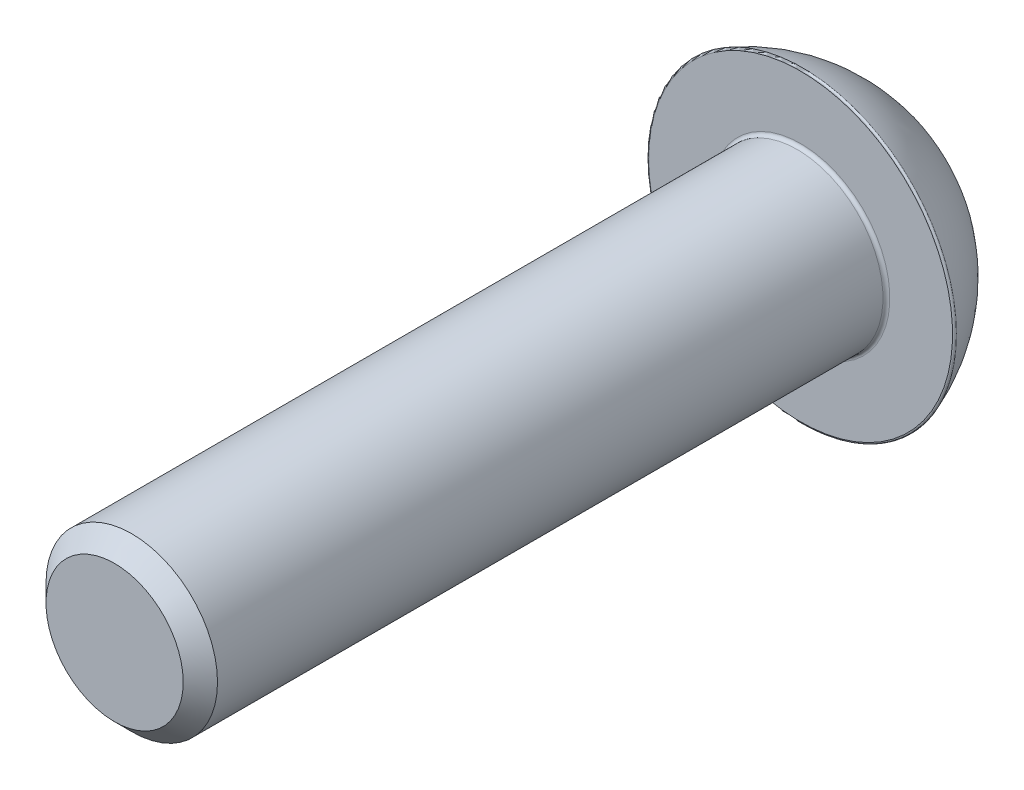
ISO-10303-21;
HEADER;
FILE_DESCRIPTION(('STEP AP214'),'2;1');
FILE_NAME('part.step','',(''),(''),'','','');
FILE_SCHEMA(('AUTOMOTIVE_DESIGN { 1 0 10303 214 1 1 1 1 }'));
ENDSEC;
DATA;
#1=APPLICATION_CONTEXT('core data for automotive mechanical design processes');
#2=APPLICATION_PROTOCOL_DEFINITION('international standard','automotive_design',2000,#1);
#3=PRODUCT_CONTEXT('',#1,'mechanical');
#4=PRODUCT('Part','Part','',(#3));
#5=PRODUCT_RELATED_PRODUCT_CATEGORY('part','',(#4));
#6=PRODUCT_DEFINITION_FORMATION('','',#4);
#7=PRODUCT_DEFINITION_CONTEXT('part definition',#1,'design');
#8=PRODUCT_DEFINITION('design','',#6,#7);
#9=PRODUCT_DEFINITION_SHAPE('','',#8);
#10=(LENGTH_UNIT() NAMED_UNIT(*) SI_UNIT(.MILLI.,.METRE.));
#11=(NAMED_UNIT(*) PLANE_ANGLE_UNIT() SI_UNIT($,.RADIAN.));
#12=(NAMED_UNIT(*) SI_UNIT($,.STERADIAN.) SOLID_ANGLE_UNIT());
#13=UNCERTAINTY_MEASURE_WITH_UNIT(LENGTH_MEASURE(1.E-05),#10,'distance_accuracy_value','');
#14=(GEOMETRIC_REPRESENTATION_CONTEXT(3) GLOBAL_UNCERTAINTY_ASSIGNED_CONTEXT((#13)) GLOBAL_UNIT_ASSIGNED_CONTEXT((#10,
#11,#12)) REPRESENTATION_CONTEXT('',''));
#15=CARTESIAN_POINT('',(0.,0.,0.));
#16=DIRECTION('',(0.,0.,1.));
#17=DIRECTION('',(1.,0.,0.));
#18=AXIS2_PLACEMENT_3D('',#15,#16,#17);
#19=CARTESIAN_POINT('',(0.,0.,20.));
#20=DIRECTION('',(0.,0.,-1.));
#21=DIRECTION('',(-1.,0.,0.));
#22=AXIS2_PLACEMENT_3D('',#19,#20,#21);
#23=CYLINDRICAL_SURFACE('',#22,2.5);
#24=CARTESIAN_POINT('',(0.,0.,19.5));
#25=DIRECTION('',(0.,0.,1.));
#26=DIRECTION('',(1.,0.,0.));
#27=AXIS2_PLACEMENT_3D('',#24,#25,#26);
#28=CIRCLE('',#27,2.5);
#29=CARTESIAN_POINT('',(2.5,0.,19.5));
#30=VERTEX_POINT('',#29);
#31=EDGE_CURVE('E257',#30,#30,#28,.F.);
#32=ORIENTED_EDGE('',*,*,#31,.T.);
#33=EDGE_LOOP('',(#32));
#34=FACE_BOUND('',#33,.T.);
#35=CARTESIAN_POINT('',(0.,0.,0.0999999999999994));
#36=DIRECTION('',(0.,0.,-1.));
#37=DIRECTION('',(-1.,0.,0.));
#38=AXIS2_PLACEMENT_3D('',#35,#36,#37);
#39=CIRCLE('',#38,2.5);
#40=CARTESIAN_POINT('',(-2.5,0.,0.0999999999999994));
#41=VERTEX_POINT('',#40);
#42=EDGE_CURVE('E273',#41,#41,#39,.F.);
#43=ORIENTED_EDGE('',*,*,#42,.T.);
#44=EDGE_LOOP('',(#43));
#45=FACE_BOUND('',#44,.T.);
#46=ADVANCED_FACE('F35',(#34,#45),#23,.T.);
#47=CARTESIAN_POINT('',(0.,0.,20.));
#48=DIRECTION('',(0.,0.,1.));
#49=DIRECTION('',(1.,0.,0.));
#50=AXIS2_PLACEMENT_3D('',#47,#48,#49);
#51=PLANE('',#50);
#52=CARTESIAN_POINT('',(0.,0.,20.));
#53=DIRECTION('',(0.,0.,1.));
#54=DIRECTION('',(1.,0.,0.));
#55=AXIS2_PLACEMENT_3D('',#52,#53,#54);
#56=CIRCLE('',#55,2.00000000000001);
#57=CARTESIAN_POINT('',(2.00000000000001,0.,20.));
#58=VERTEX_POINT('',#57);
#59=EDGE_CURVE('E260',#58,#58,#56,.T.);
#60=ORIENTED_EDGE('',*,*,#59,.T.);
#61=EDGE_LOOP('',(#60));
#62=FACE_BOUND('',#61,.T.);
#63=ADVANCED_FACE('F221',(#62),#51,.T.);
#64=CARTESIAN_POINT('',(0.,0.,0.));
#65=DIRECTION('',(0.,0.,-1.));
#66=DIRECTION('',(-1.,0.,0.));
#67=AXIS2_PLACEMENT_3D('',#64,#65,#66);
#68=PLANE('',#67);
#69=CARTESIAN_POINT('',(0.,0.,0.));
#70=DIRECTION('',(0.,0.,-1.));
#71=DIRECTION('',(-1.,0.,0.));
#72=AXIS2_PLACEMENT_3D('',#69,#70,#71);
#73=CIRCLE('',#72,4.42885793235147);
#74=CARTESIAN_POINT('',(-4.42885793235147,0.,0.));
#75=VERTEX_POINT('',#74);
#76=EDGE_CURVE('E43',#75,#75,#73,.F.);
#77=ORIENTED_EDGE('',*,*,#76,.T.);
#78=EDGE_LOOP('',(#77));
#79=FACE_BOUND('',#78,.T.);
#80=CARTESIAN_POINT('',(0.,0.,0.));
#81=DIRECTION('',(0.,0.,-1.));
#82=DIRECTION('',(-1.,0.,0.));
#83=AXIS2_PLACEMENT_3D('',#80,#81,#82);
#84=CIRCLE('',#83,2.6);
#85=CARTESIAN_POINT('',(-2.6,0.,0.));
#86=VERTEX_POINT('',#85);
#87=EDGE_CURVE('E272',#86,#86,#84,.T.);
#88=ORIENTED_EDGE('',*,*,#87,.T.);
#89=EDGE_LOOP('',(#88));
#90=FACE_BOUND('',#89,.T.);
#91=ADVANCED_FACE('F227',(#79,#90),#68,.F.);
#92=CARTESIAN_POINT('',(0.,0.,1.60844917871861));
#93=DIRECTION('',(0.,0.,1.));
#94=DIRECTION('',(1.,0.,0.));
#95=AXIS2_PLACEMENT_3D('',#92,#93,#94);
#96=DEGENERATE_TOROIDAL_SURFACE('',#95,0.0730614733982582,4.84767985741633,.F.);
#97=CARTESIAN_POINT('',(0.,0.,-0.0672838666606202));
#98=DIRECTION('',(0.,0.,1.));
#99=DIRECTION('',(1.,0.,0.));
#100=AXIS2_PLACEMENT_3D('',#97,#98,#99);
#101=CIRCLE('',#100,4.47577560442988);
#102=CARTESIAN_POINT('',(4.47577560442988,0.,-0.0672838666606202));
#103=VERTEX_POINT('',#102);
#104=EDGE_CURVE('E11',#103,#103,#101,.F.);
#105=ORIENTED_EDGE('',*,*,#104,.T.);
#106=EDGE_LOOP('',(#105));
#107=FACE_BOUND('',#106,.T.);
#108=CARTESIAN_POINT('',(0.,0.,-2.46818925995868));
#109=DIRECTION('',(0.,0.,1.));
#110=DIRECTION('',(1.,0.,0.));
#111=AXIS2_PLACEMENT_3D('',#108,#109,#110);
#112=CIRCLE('',#111,2.55010818186593);
#113=CARTESIAN_POINT('',(2.55010818186593,0.,-2.46818925995868));
#114=VERTEX_POINT('',#113);
#115=EDGE_CURVE('E255',#114,#114,#112,.T.);
#116=ORIENTED_EDGE('',*,*,#115,.T.);
#117=EDGE_LOOP('',(#116));
#118=FACE_BOUND('',#117,.T.);
#119=ADVANCED_FACE('F269',(#107,#118),#96,.F.);
#120=CARTESIAN_POINT('',(0.,0.,-2.5));
#121=DIRECTION('',(0.,0.,1.));
#122=DIRECTION('',(1.,0.,0.));
#123=AXIS2_PLACEMENT_3D('',#120,#121,#122);
#124=PLANE('',#123);
#125=CARTESIAN_POINT('',(0.,0.,-2.5));
#126=DIRECTION('',(0.,0.,1.));
#127=DIRECTION('',(1.,0.,0.));
#128=AXIS2_PLACEMENT_3D('',#125,#126,#127);
#129=CIRCLE('',#128,2.44188446526669);
#130=CARTESIAN_POINT('',(2.44188446526669,0.,-2.5));
#131=VERTEX_POINT('',#130);
#132=EDGE_CURVE('E252',#131,#131,#129,.F.);
#133=ORIENTED_EDGE('',*,*,#132,.T.);
#134=EDGE_LOOP('',(#133));
#135=FACE_BOUND('',#134,.T.);
#136=CARTESIAN_POINT('',(0.,0.,-2.5));
#137=DIRECTION('',(0.,0.,1.));
#138=DIRECTION('',(1.,0.,0.));
#139=AXIS2_PLACEMENT_3D('',#136,#137,#138);
#140=CIRCLE('',#139,2.);
#141=CARTESIAN_POINT('',(0.,-2.,-2.5));
#142=VERTEX_POINT('',#141);
#143=CARTESIAN_POINT('',(1.73205080756888,-1.,-2.5));
#144=VERTEX_POINT('',#143);
#145=EDGE_CURVE('E352',#142,#144,#140,.T.);
#146=ORIENTED_EDGE('',*,*,#145,.T.);
#147=CARTESIAN_POINT('',(1.73205080756888,1.,-2.5));
#148=VERTEX_POINT('',#147);
#149=EDGE_CURVE('E354',#144,#148,#140,.T.);
#150=ORIENTED_EDGE('',*,*,#149,.T.);
#151=CARTESIAN_POINT('',(0.,2.,-2.5));
#152=VERTEX_POINT('',#151);
#153=EDGE_CURVE('E142',#148,#152,#140,.T.);
#154=ORIENTED_EDGE('',*,*,#153,.T.);
#155=CARTESIAN_POINT('',(-1.73205080756888,1.,-2.5));
#156=VERTEX_POINT('',#155);
#157=EDGE_CURVE('E356',#152,#156,#140,.T.);
#158=ORIENTED_EDGE('',*,*,#157,.T.);
#159=CARTESIAN_POINT('',(-1.73205080756888,-1.,-2.5));
#160=VERTEX_POINT('',#159);
#161=EDGE_CURVE('E50',#156,#160,#140,.T.);
#162=ORIENTED_EDGE('',*,*,#161,.T.);
#163=EDGE_CURVE('E58',#160,#142,#140,.T.);
#164=ORIENTED_EDGE('',*,*,#163,.T.);
#165=EDGE_LOOP('',(#146,#150,#154,#158,#162,#164));
#166=FACE_BOUND('',#165,.T.);
#167=ADVANCED_FACE('F353',(#135,#166),#124,.F.);
#168=CARTESIAN_POINT('',(0.,0.,-2.5));
#169=DIRECTION('',(0.,0.,-1.));
#170=DIRECTION('',(-1.,0.,0.));
#171=AXIS2_PLACEMENT_3D('',#168,#169,#170);
#172=CONICAL_SURFACE('',#171,2.,0.785398163397464);
#173=CARTESIAN_POINT('',(2.94158946981366,0.301672527757715,-3.45701791048383));
#174=CARTESIAN_POINT('',(2.90054820306106,0.325367714165214,-3.41861088775276));
#175=CARTESIAN_POINT('',(2.85934407611677,0.349156927948219,-3.38043624181836));
#176=CARTESIAN_POINT('',(2.77655399714269,0.396955802330134,-3.30463467220862));
#177=CARTESIAN_POINT('',(2.73496801183124,0.42096548214422,-3.26700779702867));
#178=CARTESIAN_POINT('',(2.60936968777962,0.493479708345186,-3.15490999544632));
#179=CARTESIAN_POINT('',(2.5247072531673,0.542359587758857,-3.08140122304804));
#180=CARTESIAN_POINT('',(2.35073780566959,0.642800895102431,-2.93602500622905));
#181=CARTESIAN_POINT('',(2.26136709370547,0.694399099712587,-2.86425858846806));
#182=CARTESIAN_POINT('',(2.0794570373247,0.799424919732323,-2.72641286560296));
#183=CARTESIAN_POINT('',(1.98692096820441,0.85285064414867,-2.66032791651927));
#184=CARTESIAN_POINT('',(1.84369065399249,0.93554470461504,-2.56695989412528));
#185=CARTESIAN_POINT('',(1.7945811381766,0.963898096791116,-2.53646155718601));
#186=CARTESIAN_POINT('',(1.69509291274447,1.02133765052556,-2.47838413728683));
#187=CARTESIAN_POINT('',(1.64471402333495,1.05042391588761,-2.45080547077753));
#188=CARTESIAN_POINT('',(1.49196731568369,1.1386122686679,-2.37384077286726));
#189=CARTESIAN_POINT('',(1.3873857985501,1.19899243573724,-2.32981215735098));
#190=CARTESIAN_POINT('',(1.23717311405262,1.28571776956755,-2.28363805404776));
#191=CARTESIAN_POINT('',(1.19365445015741,1.31084328188222,-2.27218573919536));
#192=CARTESIAN_POINT('',(1.10596861828131,1.36146872052001,-2.25336637230745));
#193=CARTESIAN_POINT('',(1.0618018111858,1.38696843848585,-2.24599712926544));
#194=CARTESIAN_POINT('',(0.973146461030204,1.43815362876328,-2.23571640805521));
#195=CARTESIAN_POINT('',(0.928658532222327,1.4638387464362,-2.23279794685668));
#196=CARTESIAN_POINT('',(0.839632922634738,1.51523770609636,-2.23155642002916));
#197=CARTESIAN_POINT('',(0.795095241343887,1.54095154837872,-2.2332334020544));
#198=CARTESIAN_POINT('',(0.706440848380417,1.59213618602102,-2.24107938880437));
#199=CARTESIAN_POINT('',(0.662323335765045,1.61760744380548,-2.24723652307604));
#200=CARTESIAN_POINT('',(0.574673389436376,1.66821216391279,-2.2637136889748));
#201=CARTESIAN_POINT('',(0.53114109317743,1.69334554687634,-2.27403468153826));
#202=CARTESIAN_POINT('',(0.444741731936133,1.74322824134681,-2.29841359085713));
#203=CARTESIAN_POINT('',(0.401877013517881,1.76797619806433,-2.31248246281217));
#204=CARTESIAN_POINT('',(0.317047721634734,1.81695241256823,-2.34382249131036));
#205=CARTESIAN_POINT('',(0.275083105846792,1.84118069478984,-2.3610934969185));
#206=CARTESIAN_POINT('',(0.177297122017564,1.89763745887661,-2.40496018759254));
#207=CARTESIAN_POINT('',(0.121857868703136,1.92964532670137,-2.43268721383462));
#208=CARTESIAN_POINT('',(0.0125458632819769,1.99275664245693,-2.49201679649198));
#209=CARTESIAN_POINT('',(-0.0413260410279839,2.02385960091205,-2.52362140383094));
#210=CARTESIAN_POINT('',(-0.14775811911081,2.08530818984358,-2.58989445723361));
#211=CARTESIAN_POINT('',(-0.200315623267853,2.11565227901658,-2.62456857718946));
#212=CARTESIAN_POINT('',(-0.304213261540016,2.17563760844118,-2.6962783647953));
#213=CARTESIAN_POINT('',(-0.355553147845237,2.20527870561967,-2.73331450760173));
#214=CARTESIAN_POINT('',(-0.508466388508618,2.29356320627933,-2.84751729849592));
#215=CARTESIAN_POINT('',(-0.608470524320648,2.35130062101048,-2.92747850597251));
#216=CARTESIAN_POINT('',(-0.805373062193957,2.46498235425575,-3.09203693837764));
#217=CARTESIAN_POINT('',(-0.902274442488781,2.52092839225382,-3.17662949268825));
#218=CARTESIAN_POINT('',(-1.03368363007372,2.59679752207997,-3.29485315914613));
#219=CARTESIAN_POINT('',(-1.06913158942042,2.61726341095101,-3.32710126056327));
#220=CARTESIAN_POINT('',(-1.13960476859819,2.65795111991995,-3.39185009846864));
#221=CARTESIAN_POINT('',(-1.17463115237199,2.67817361202049,-3.42434914515027));
#222=CARTESIAN_POINT('',(-1.20953866224478,2.69832747224228,-3.45701791048383));
#223=B_SPLINE_CURVE_WITH_KNOTS('',3,(#173,#174,#175,#176,#177,#178,#179,#180,#181,#182,#183,
#184,#185,#186,#187,#188,#189,#190,#191,#192,#193,#194,#195,#196,#197,#198,#199,#200,#201,#202,
#203,#204,#205,#206,#207,#208,#209,#210,#211,#212,#213,#214,#215,#216,#217,#218,#219,#220,#221,
#222),.UNSPECIFIED.,.F.,.F.,(4,2,2,2,2,2,2,2,2,2,2,2,2,2,2,2,2,2,2,2,2,2,2,2,4),(0.,
0.182996881947533,0.366009867688156,0.732886431009816,1.10987139321715,1.48647742315226,
1.67955931677414,1.87266871385733,2.25646583386288,2.4109495098745,2.56535020832046,
2.71950841049156,2.87366821127221,3.02742103616511,3.18120936449388,3.33545225078582,
3.48968786856955,3.69879949491993,3.90802220494845,4.11764007103227,4.32730023873137,
4.74845496075302,5.16919251202504,5.32551792707861,5.48116901833325),.UNSPECIFIED.);
#224=CARTESIAN_POINT('',(1.0825317547305,1.37500000000003,-2.25));
#225=VERTEX_POINT('',#224);
#226=EDGE_CURVE('E277',#148,#225,#223,.T.);
#227=ORIENTED_EDGE('',*,*,#226,.T.);
#228=CARTESIAN_POINT('',(0.,0.,-2.25));
#229=DIRECTION('',(0.,0.,1.));
#230=DIRECTION('',(1.,0.,0.));
#231=AXIS2_PLACEMENT_3D('',#228,#229,#230);
#232=CIRCLE('',#231,1.74999999999999);
#233=CARTESIAN_POINT('',(0.649519052838328,1.625,-2.2499999999999));
#234=VERTEX_POINT('',#233);
#235=EDGE_CURVE('E144',#225,#234,#232,.T.);
#236=ORIENTED_EDGE('',*,*,#235,.T.);
#237=EDGE_CURVE('E183',#234,#152,#223,.T.);
#238=ORIENTED_EDGE('',*,*,#237,.T.);
#239=ORIENTED_EDGE('',*,*,#153,.F.);
#240=EDGE_LOOP('',(#227,#236,#238,#239));
#241=FACE_BOUND('',#240,.T.);
#242=ADVANCED_FACE('F178',(#241),#172,.F.);
#243=CARTESIAN_POINT('',(-1.03602170322205,0.,-2.25));
#244=DIRECTION('',(0.,0.,-1.));
#245=DIRECTION('',(-1.,0.,0.));
#246=AXIS2_PLACEMENT_3D('',#243,#244,#245);
#247=PLANE('',#246);
#248=DIRECTION('',(-0.866025403784439,0.5,0.));
#249=VECTOR('',#248,1.);
#250=CARTESIAN_POINT('',(0.,2.,-2.25));
#251=LINE('',#250,#249);
#252=EDGE_CURVE('E279',#225,#234,#251,.T.);
#253=ORIENTED_EDGE('',*,*,#252,.T.);
#254=ORIENTED_EDGE('',*,*,#235,.F.);
#255=EDGE_LOOP('',(#253,#254));
#256=FACE_BOUND('',#255,.T.);
#257=ADVANCED_FACE('F377',(#256),#247,.T.);
#258=CARTESIAN_POINT('',(1.73205080756888,-2.20953866224478,-3.30750086374952));
#259=CARTESIAN_POINT('',(1.73205080756888,-2.16003774292392,-3.26854770991106));
#260=CARTESIAN_POINT('',(1.73205080756888,-2.11029859551212,-3.22989532998384));
#261=CARTESIAN_POINT('',(1.73205080756888,-2.01025350475341,-3.15331464252198));
#262=CARTESIAN_POINT('',(1.73205080756888,-1.95994746976887,-3.11538645480277));
#263=CARTESIAN_POINT('',(1.73205080756888,-1.80756515853564,-3.00251867863908));
#264=CARTESIAN_POINT('',(1.73205080756888,-1.70451469556623,-2.92888539518598));
#265=CARTESIAN_POINT('',(1.73205080756888,-1.48974567258168,-2.78315035985774));
#266=CARTESIAN_POINT('',(1.73205080756888,-1.37785030243363,-2.71130345302926));
#267=CARTESIAN_POINT('',(1.73205080756888,-1.20621942916504,-2.61017987736858));
#268=CARTESIAN_POINT('',(1.73205080756888,-1.14843183163697,-2.57760629408282));
#269=CARTESIAN_POINT('',(1.73205080756888,-1.03137111725485,-2.5152583383088));
#270=CARTESIAN_POINT('',(1.73205080756888,-0.972098407971885,-2.48548320824883));
#271=CARTESIAN_POINT('',(1.73205080756888,-0.858105693140784,-2.43237540503449));
#272=CARTESIAN_POINT('',(1.73205080756888,-0.803548891652765,-2.40869491573103));
#273=CARTESIAN_POINT('',(1.73205080756888,-0.693014863452331,-2.36485819387741));
#274=CARTESIAN_POINT('',(1.73205080756888,-0.637037501162468,-2.3447022991719));
#275=CARTESIAN_POINT('',(1.73205080756888,-0.52434006177346,-2.30889830947306));
#276=CARTESIAN_POINT('',(1.73205080756888,-0.467635627334539,-2.29320164405921));
#277=CARTESIAN_POINT('',(1.73205080756888,-0.353082090047645,-2.2667952053854));
#278=CARTESIAN_POINT('',(1.73205080756888,-0.295233455956503,-2.25608343228657));
#279=CARTESIAN_POINT('',(1.73205080756888,-0.177663478362412,-2.24014746704646));
#280=CARTESIAN_POINT('',(1.73205080756888,-0.117927358659817,-2.23502992677743));
#281=CARTESIAN_POINT('',(1.73205080756888,0.00175221533039251,-2.23101921651208));
#282=CARTESIAN_POINT('',(1.73205080756888,0.0616956506781376,-2.23212549218987));
#283=CARTESIAN_POINT('',(1.73205080756888,0.181324820605544,-2.24049007902535));
#284=CARTESIAN_POINT('',(1.73205080756888,0.241009234947088,-2.2477669123411));
#285=CARTESIAN_POINT('',(1.73205080756888,0.359405486108111,-2.26798305517523));
#286=CARTESIAN_POINT('',(1.73205080756888,0.418117057643388,-2.28092388366719));
#287=CARTESIAN_POINT('',(1.73205080756888,0.552105060773188,-2.31644082242582));
#288=CARTESIAN_POINT('',(1.73205080756888,0.626916520574709,-2.34075675412311));
#289=CARTESIAN_POINT('',(1.73205080756888,0.774075367531531,-2.39592335725754));
#290=CARTESIAN_POINT('',(1.73205080756888,0.846421250524866,-2.42677793769288));
#291=CARTESIAN_POINT('',(1.73205080756888,0.989293258400782,-2.49366177566024));
#292=CARTESIAN_POINT('',(1.73205080756888,1.05980221806542,-2.52972720625138));
#293=CARTESIAN_POINT('',(1.73205080756888,1.1987293351769,-2.60560407134367));
#294=CARTESIAN_POINT('',(1.73205080756888,1.26714797408387,-2.64541463448506));
#295=CARTESIAN_POINT('',(1.73205080756888,1.4119086407703,-2.73377306806856));
#296=CARTESIAN_POINT('',(1.73205080756888,1.48798334009385,-2.78275599574708));
#297=CARTESIAN_POINT('',(1.73205080756888,1.63830160155821,-2.88346919502732));
#298=CARTESIAN_POINT('',(1.73205080756888,1.71254475250879,-2.93520007548232));
#299=CARTESIAN_POINT('',(1.73205080756888,1.85790523933445,-3.03954737647409));
#300=CARTESIAN_POINT('',(1.73205080756888,1.92905536369813,-3.09211837949309));
#301=CARTESIAN_POINT('',(1.73205080756888,2.0701353071594,-3.19877246787936));
#302=CARTESIAN_POINT('',(1.73205080756888,2.14006596377276,-3.25285444328612));
#303=CARTESIAN_POINT('',(1.73205080756888,2.20953866224478,-3.30750086374952));
#304=B_SPLINE_CURVE_WITH_KNOTS('',3,(#258,#259,#260,#261,#262,#263,#264,#265,#266,#267,#268,
#269,#270,#271,#272,#273,#274,#275,#276,#277,#278,#279,#280,#281,#282,#283,#284,#285,#286,#287,
#288,#289,#290,#291,#292,#293,#294,#295,#296,#297,#298,#299,#300,#301,#302,#303),.UNSPECIFIED.,
.F.,.F.,(4,2,2,2,2,2,2,2,2,2,2,2,2,2,2,2,2,2,2,2,2,2,4),(0.,0.188968857866588,0.377968713796086,
0.75784542090729,1.15646627204579,1.35541698128167,1.55431367632624,1.73263836496975,
1.91098013729719,2.0872975796309,2.26354422583281,2.44309531324709,2.62263040914725,
2.80270633088305,2.98283057510454,3.21840857937478,3.45412781848467,3.69156991162936,
3.92895689639565,4.20031630429641,4.47173608908867,4.73710791306651,5.00228967084841),.UNSPECIFIED.);
#305=CARTESIAN_POINT('',(1.73205080756888,-0.249999999999946,-2.25));
#306=VERTEX_POINT('',#305);
#307=EDGE_CURVE('E140',#144,#306,#304,.T.);
#308=ORIENTED_EDGE('',*,*,#307,.T.);
#309=CARTESIAN_POINT('',(1.73205080756888,0.249999999999946,-2.25));
#310=VERTEX_POINT('',#309);
#311=EDGE_CURVE('E128',#306,#310,#232,.T.);
#312=ORIENTED_EDGE('',*,*,#311,.T.);
#313=EDGE_CURVE('E138',#310,#148,#304,.T.);
#314=ORIENTED_EDGE('',*,*,#313,.T.);
#315=ORIENTED_EDGE('',*,*,#149,.F.);
#316=EDGE_LOOP('',(#308,#312,#314,#315));
#317=FACE_BOUND('',#316,.T.);
#318=ADVANCED_FACE('F137',(#317),#172,.F.);
#319=DIRECTION('',(0.,1.,0.));
#320=VECTOR('',#319,1.);
#321=CARTESIAN_POINT('',(1.73205080756888,1.,-2.25));
#322=LINE('',#321,#320);
#323=EDGE_CURVE('E125',#306,#310,#322,.T.);
#324=ORIENTED_EDGE('',*,*,#323,.T.);
#325=ORIENTED_EDGE('',*,*,#311,.F.);
#326=EDGE_LOOP('',(#324,#325));
#327=FACE_BOUND('',#326,.T.);
#328=ADVANCED_FACE('F127',(#327),#247,.T.);
#329=CARTESIAN_POINT('',(-1.20953866224478,-2.69832747224228,-3.45701791048383));
#330=CARTESIAN_POINT('',(-1.16849739549218,-2.67463228583479,-3.41861088775276));
#331=CARTESIAN_POINT('',(-1.1272932685479,-2.65084307205178,-3.38043624181836));
#332=CARTESIAN_POINT('',(-1.04450318957382,-2.60304419766987,-3.30463467220862));
#333=CARTESIAN_POINT('',(-1.00291720426236,-2.57903451785578,-3.26700779702866));
#334=CARTESIAN_POINT('',(-0.877318880210744,-2.50652029165481,-3.15490999544632));
#335=CARTESIAN_POINT('',(-0.792656445598425,-2.45764041224114,-3.08140122304803));
#336=CARTESIAN_POINT('',(-0.618686998100713,-2.35719910489757,-2.93602500622905));
#337=CARTESIAN_POINT('',(-0.529316286136589,-2.30560090028741,-2.86425858846806));
#338=CARTESIAN_POINT('',(-0.347406229755821,-2.20057508026768,-2.72641286560296));
#339=CARTESIAN_POINT('',(-0.254870160635534,-2.14714935585133,-2.66032791651927));
#340=CARTESIAN_POINT('',(-0.111639846423609,-2.06445529538496,-2.56695989412528));
#341=CARTESIAN_POINT('',(-0.0625303306077192,-2.03610190320888,-2.53646155718601));
#342=CARTESIAN_POINT('',(0.0369578948244125,-1.97866234947444,-2.47838413728683));
#343=CARTESIAN_POINT('',(0.0873367842339266,-1.94957608411239,-2.45080547077753));
#344=CARTESIAN_POINT('',(0.240083491885193,-1.8613877313321,-2.37384077286726));
#345=CARTESIAN_POINT('',(0.344665009018783,-1.80100756426276,-2.32981215735098));
#346=CARTESIAN_POINT('',(0.494877693516263,-1.71428223043244,-2.28363805404776));
#347=CARTESIAN_POINT('',(0.538396357411468,-1.68915671811777,-2.27218573919535));
#348=CARTESIAN_POINT('',(0.626082189287566,-1.63853127947999,-2.25336637230745));
#349=CARTESIAN_POINT('',(0.670248996383079,-1.61303156151415,-2.24599712926544));
#350=CARTESIAN_POINT('',(0.758904346538675,-1.56184637123672,-2.23571640805521));
#351=CARTESIAN_POINT('',(0.803392275346552,-1.5361612535638,-2.23279794685668));
#352=CARTESIAN_POINT('',(0.89241788493414,-1.48476229390364,-2.23155642002916));
#353=CARTESIAN_POINT('',(0.936955566224992,-1.45904845162128,-2.2332334020544));
#354=CARTESIAN_POINT('',(1.02560995918846,-1.40786381397898,-2.24107938880437));
#355=CARTESIAN_POINT('',(1.06972747180383,-1.38239255619452,-2.24723652307604));
#356=CARTESIAN_POINT('',(1.1573774181325,-1.33178783608721,-2.2637136889748));
#357=CARTESIAN_POINT('',(1.20090971439145,-1.30665445312366,-2.27403468153826));
#358=CARTESIAN_POINT('',(1.28730907563275,-1.25677175865319,-2.29841359085713));
#359=CARTESIAN_POINT('',(1.330173794051,-1.23202380193567,-2.31248246281217));
#360=CARTESIAN_POINT('',(1.41500308593414,-1.18304758743177,-2.34382249131036));
#361=CARTESIAN_POINT('',(1.45696770172209,-1.15881930521016,-2.3610934969185));
#362=CARTESIAN_POINT('',(1.55475368555131,-1.10236254112339,-2.40496018759254));
#363=CARTESIAN_POINT('',(1.61019293886574,-1.07035467329863,-2.43268721383462));
#364=CARTESIAN_POINT('',(1.7195049442869,-1.00724335754306,-2.49201679649198));
#365=CARTESIAN_POINT('',(1.77337684859686,-0.976140399087951,-2.52362140383094));
#366=CARTESIAN_POINT('',(1.87980892667969,-0.91469181015642,-2.58989445723362));
#367=CARTESIAN_POINT('',(1.93236643083673,-0.884347720983416,-2.62456857718947));
#368=CARTESIAN_POINT('',(2.0362640691089,-0.824362391558816,-2.6962783647953));
#369=CARTESIAN_POINT('',(2.08760395541412,-0.794721294380332,-2.73331450760174));
#370=CARTESIAN_POINT('',(2.2405171960775,-0.706436793720671,-2.84751729849592));
#371=CARTESIAN_POINT('',(2.34052133188953,-0.648699378989519,-2.92747850597251));
#372=CARTESIAN_POINT('',(2.53742386976284,-0.535017645744244,-3.09203693837765));
#373=CARTESIAN_POINT('',(2.63432525005766,-0.47907160774618,-3.17662949268825));
#374=CARTESIAN_POINT('',(2.7657344376426,-0.403202477920025,-3.29485315914614));
#375=CARTESIAN_POINT('',(2.8011823969893,-0.382736589048988,-3.32710126056327));
#376=CARTESIAN_POINT('',(2.87165557616707,-0.342048880080053,-3.39185009846864));
#377=CARTESIAN_POINT('',(2.90668195994087,-0.321826387979509,-3.42434914515027));
#378=CARTESIAN_POINT('',(2.94158946981366,-0.301672527757715,-3.45701791048383));
#379=B_SPLINE_CURVE_WITH_KNOTS('',3,(#329,#330,#331,#332,#333,#334,#335,#336,#337,#338,#339,
#340,#341,#342,#343,#344,#345,#346,#347,#348,#349,#350,#351,#352,#353,#354,#355,#356,#357,#358,
#359,#360,#361,#362,#363,#364,#365,#366,#367,#368,#369,#370,#371,#372,#373,#374,#375,#376,#377,
#378),.UNSPECIFIED.,.F.,.F.,(4,2,2,2,2,2,2,2,2,2,2,2,2,2,2,2,2,2,2,2,2,2,2,2,4),(0.,
0.182996881947534,0.366009867688157,0.732886431009818,1.10987139321715,1.48647742315226,
1.67955931677414,1.87266871385733,2.25646583386288,2.4109495098745,2.56535020832046,
2.71950841049156,2.87366821127221,3.02742103616511,3.18120936449388,3.33545225078582,
3.48968786856955,3.69879949491993,3.90802220494845,4.11764007103227,4.32730023873137,
4.74845496075303,5.16919251202505,5.32551792707861,5.48116901833325),.UNSPECIFIED.);
#380=CARTESIAN_POINT('',(0.649519052838376,-1.62499999999997,-2.25));
#381=VERTEX_POINT('',#380);
#382=EDGE_CURVE('E199',#142,#381,#379,.T.);
#383=ORIENTED_EDGE('',*,*,#382,.T.);
#384=CARTESIAN_POINT('',(1.0825317547305,-1.37500000000003,-2.25));
#385=VERTEX_POINT('',#384);
#386=EDGE_CURVE('E141',#381,#385,#232,.T.);
#387=ORIENTED_EDGE('',*,*,#386,.T.);
#388=EDGE_CURVE('E151',#385,#144,#379,.T.);
#389=ORIENTED_EDGE('',*,*,#388,.T.);
#390=ORIENTED_EDGE('',*,*,#145,.F.);
#391=EDGE_LOOP('',(#383,#387,#389,#390));
#392=FACE_BOUND('',#391,.T.);
#393=ADVANCED_FACE('F346',(#392),#172,.F.);
#394=DIRECTION('',(0.866025403784439,0.5,0.));
#395=VECTOR('',#394,1.);
#396=CARTESIAN_POINT('',(1.73205080756888,-1.,-2.25));
#397=LINE('',#396,#395);
#398=EDGE_CURVE('E132',#381,#385,#397,.T.);
#399=ORIENTED_EDGE('',*,*,#398,.T.);
#400=ORIENTED_EDGE('',*,*,#386,.F.);
#401=EDGE_LOOP('',(#399,#400));
#402=FACE_BOUND('',#401,.T.);
#403=ADVANCED_FACE('F342',(#402),#247,.T.);
#404=CARTESIAN_POINT('',(-2.94158946981366,-0.301672527757715,-3.45701791048383));
#405=CARTESIAN_POINT('',(-2.90054820306106,-0.325367714165214,-3.41861088775276));
#406=CARTESIAN_POINT('',(-2.85934407611677,-0.349156927948219,-3.38043624181836));
#407=CARTESIAN_POINT('',(-2.77655399714269,-0.396955802330134,-3.30463467220862));
#408=CARTESIAN_POINT('',(-2.73496801183124,-0.42096548214422,-3.26700779702867));
#409=CARTESIAN_POINT('',(-2.60936968777962,-0.493479708345186,-3.15490999544632));
#410=CARTESIAN_POINT('',(-2.5247072531673,-0.542359587758857,-3.08140122304804));
#411=CARTESIAN_POINT('',(-2.35073780566959,-0.642800895102431,-2.93602500622905));
#412=CARTESIAN_POINT('',(-2.26136709370547,-0.694399099712587,-2.86425858846806));
#413=CARTESIAN_POINT('',(-2.0794570373247,-0.799424919732323,-2.72641286560296));
#414=CARTESIAN_POINT('',(-1.98692096820441,-0.85285064414867,-2.66032791651927));
#415=CARTESIAN_POINT('',(-1.84369065399249,-0.93554470461504,-2.56695989412528));
#416=CARTESIAN_POINT('',(-1.7945811381766,-0.963898096791116,-2.53646155718601));
#417=CARTESIAN_POINT('',(-1.69509291274447,-1.02133765052556,-2.47838413728683));
#418=CARTESIAN_POINT('',(-1.64471402333495,-1.05042391588761,-2.45080547077753));
#419=CARTESIAN_POINT('',(-1.49196731568369,-1.1386122686679,-2.37384077286726));
#420=CARTESIAN_POINT('',(-1.3873857985501,-1.19899243573724,-2.32981215735098));
#421=CARTESIAN_POINT('',(-1.23717311405262,-1.28571776956755,-2.28363805404776));
#422=CARTESIAN_POINT('',(-1.19365445015741,-1.31084328188222,-2.27218573919536));
#423=CARTESIAN_POINT('',(-1.10596861828131,-1.36146872052001,-2.25336637230745));
#424=CARTESIAN_POINT('',(-1.0618018111858,-1.38696843848585,-2.24599712926544));
#425=CARTESIAN_POINT('',(-0.973146461030204,-1.43815362876328,-2.23571640805521));
#426=CARTESIAN_POINT('',(-0.928658532222327,-1.4638387464362,-2.23279794685668));
#427=CARTESIAN_POINT('',(-0.839632922634738,-1.51523770609636,-2.23155642002916));
#428=CARTESIAN_POINT('',(-0.795095241343887,-1.54095154837872,-2.2332334020544));
#429=CARTESIAN_POINT('',(-0.706440848380417,-1.59213618602102,-2.24107938880437));
#430=CARTESIAN_POINT('',(-0.662323335765045,-1.61760744380548,-2.24723652307604));
#431=CARTESIAN_POINT('',(-0.574673389436376,-1.66821216391279,-2.2637136889748));
#432=CARTESIAN_POINT('',(-0.53114109317743,-1.69334554687634,-2.27403468153826));
#433=CARTESIAN_POINT('',(-0.444741731936133,-1.74322824134681,-2.29841359085713));
#434=CARTESIAN_POINT('',(-0.401877013517881,-1.76797619806433,-2.31248246281217));
#435=CARTESIAN_POINT('',(-0.317047721634734,-1.81695241256823,-2.34382249131036));
#436=CARTESIAN_POINT('',(-0.275083105846792,-1.84118069478984,-2.3610934969185));
#437=CARTESIAN_POINT('',(-0.177297122017564,-1.89763745887661,-2.40496018759254));
#438=CARTESIAN_POINT('',(-0.121857868703136,-1.92964532670137,-2.43268721383462));
#439=CARTESIAN_POINT('',(-0.0125458632819769,-1.99275664245693,-2.49201679649198));
#440=CARTESIAN_POINT('',(0.0413260410279839,-2.02385960091205,-2.52362140383094));
#441=CARTESIAN_POINT('',(0.14775811911081,-2.08530818984358,-2.58989445723361));
#442=CARTESIAN_POINT('',(0.200315623267853,-2.11565227901658,-2.62456857718946));
#443=CARTESIAN_POINT('',(0.304213261540016,-2.17563760844118,-2.6962783647953));
#444=CARTESIAN_POINT('',(0.355553147845237,-2.20527870561967,-2.73331450760173));
#445=CARTESIAN_POINT('',(0.508466388508618,-2.29356320627933,-2.84751729849592));
#446=CARTESIAN_POINT('',(0.608470524320648,-2.35130062101048,-2.92747850597251));
#447=CARTESIAN_POINT('',(0.805373062193957,-2.46498235425575,-3.09203693837764));
#448=CARTESIAN_POINT('',(0.902274442488781,-2.52092839225382,-3.17662949268825));
#449=CARTESIAN_POINT('',(1.03368363007372,-2.59679752207997,-3.29485315914613));
#450=CARTESIAN_POINT('',(1.06913158942042,-2.61726341095101,-3.32710126056327));
#451=CARTESIAN_POINT('',(1.13960476859819,-2.65795111991995,-3.39185009846864));
#452=CARTESIAN_POINT('',(1.17463115237199,-2.67817361202049,-3.42434914515027));
#453=CARTESIAN_POINT('',(1.20953866224478,-2.69832747224228,-3.45701791048383));
#454=B_SPLINE_CURVE_WITH_KNOTS('',3,(#404,#405,#406,#407,#408,#409,#410,#411,#412,#413,#414,
#415,#416,#417,#418,#419,#420,#421,#422,#423,#424,#425,#426,#427,#428,#429,#430,#431,#432,#433,
#434,#435,#436,#437,#438,#439,#440,#441,#442,#443,#444,#445,#446,#447,#448,#449,#450,#451,#452,
#453),.UNSPECIFIED.,.F.,.F.,(4,2,2,2,2,2,2,2,2,2,2,2,2,2,2,2,2,2,2,2,2,2,2,2,4),(0.,
0.182996881947533,0.366009867688156,0.732886431009816,1.10987139321715,1.48647742315226,
1.67955931677414,1.87266871385733,2.25646583386288,2.4109495098745,2.56535020832046,
2.71950841049156,2.87366821127221,3.02742103616511,3.18120936449388,3.33545225078582,
3.48968786856955,3.69879949491993,3.90802220494845,4.11764007103227,4.32730023873137,
4.74845496075302,5.16919251202504,5.32551792707861,5.48116901833325),.UNSPECIFIED.);
#455=CARTESIAN_POINT('',(-1.0825317547305,-1.37500000000003,-2.25));
#456=VERTEX_POINT('',#455);
#457=EDGE_CURVE('E198',#160,#456,#454,.T.);
#458=ORIENTED_EDGE('',*,*,#457,.T.);
#459=CARTESIAN_POINT('',(-0.649519052838376,-1.62499999999997,-2.25));
#460=VERTEX_POINT('',#459);
#461=EDGE_CURVE('E347',#456,#460,#232,.T.);
#462=ORIENTED_EDGE('',*,*,#461,.T.);
#463=EDGE_CURVE('E193',#460,#142,#454,.T.);
#464=ORIENTED_EDGE('',*,*,#463,.T.);
#465=ORIENTED_EDGE('',*,*,#163,.F.);
#466=EDGE_LOOP('',(#458,#462,#464,#465));
#467=FACE_BOUND('',#466,.T.);
#468=ADVANCED_FACE('F371',(#467),#172,.F.);
#469=DIRECTION('',(0.866025403784439,-0.5,0.));
#470=VECTOR('',#469,1.);
#471=CARTESIAN_POINT('',(0.,-2.,-2.25));
#472=LINE('',#471,#470);
#473=EDGE_CURVE('E336',#456,#460,#472,.T.);
#474=ORIENTED_EDGE('',*,*,#473,.T.);
#475=ORIENTED_EDGE('',*,*,#461,.F.);
#476=EDGE_LOOP('',(#474,#475));
#477=FACE_BOUND('',#476,.T.);
#478=ADVANCED_FACE('F375',(#477),#247,.T.);
#479=CARTESIAN_POINT('',(-1.73205080756888,2.20953866224478,-3.30750086374952));
#480=CARTESIAN_POINT('',(-1.73205080756888,2.16003774292392,-3.26854770991106));
#481=CARTESIAN_POINT('',(-1.73205080756888,2.11029859551212,-3.22989532998384));
#482=CARTESIAN_POINT('',(-1.73205080756888,2.01025350475341,-3.15331464252198));
#483=CARTESIAN_POINT('',(-1.73205080756888,1.95994746976887,-3.11538645480277));
#484=CARTESIAN_POINT('',(-1.73205080756888,1.80756515853564,-3.00251867863908));
#485=CARTESIAN_POINT('',(-1.73205080756888,1.70451469556623,-2.92888539518598));
#486=CARTESIAN_POINT('',(-1.73205080756888,1.48974567258168,-2.78315035985774));
#487=CARTESIAN_POINT('',(-1.73205080756888,1.37785030243363,-2.71130345302926));
#488=CARTESIAN_POINT('',(-1.73205080756888,1.20621942916504,-2.61017987736858));
#489=CARTESIAN_POINT('',(-1.73205080756888,1.14843183163697,-2.57760629408282));
#490=CARTESIAN_POINT('',(-1.73205080756888,1.03137111725485,-2.5152583383088));
#491=CARTESIAN_POINT('',(-1.73205080756888,0.972098407971885,-2.48548320824883));
#492=CARTESIAN_POINT('',(-1.73205080756888,0.858105693140784,-2.43237540503449));
#493=CARTESIAN_POINT('',(-1.73205080756888,0.803548891652765,-2.40869491573103));
#494=CARTESIAN_POINT('',(-1.73205080756888,0.693014863452331,-2.36485819387741));
#495=CARTESIAN_POINT('',(-1.73205080756888,0.637037501162468,-2.3447022991719));
#496=CARTESIAN_POINT('',(-1.73205080756888,0.52434006177346,-2.30889830947306));
#497=CARTESIAN_POINT('',(-1.73205080756888,0.467635627334539,-2.29320164405921));
#498=CARTESIAN_POINT('',(-1.73205080756888,0.353082090047645,-2.2667952053854));
#499=CARTESIAN_POINT('',(-1.73205080756888,0.295233455956503,-2.25608343228657));
#500=CARTESIAN_POINT('',(-1.73205080756888,0.177663478362412,-2.24014746704646));
#501=CARTESIAN_POINT('',(-1.73205080756888,0.117927358659817,-2.23502992677743));
#502=CARTESIAN_POINT('',(-1.73205080756888,-0.00175221533039251,-2.23101921651208));
#503=CARTESIAN_POINT('',(-1.73205080756888,-0.0616956506781376,-2.23212549218987));
#504=CARTESIAN_POINT('',(-1.73205080756888,-0.181324820605544,-2.24049007902535));
#505=CARTESIAN_POINT('',(-1.73205080756888,-0.241009234947088,-2.2477669123411));
#506=CARTESIAN_POINT('',(-1.73205080756888,-0.359405486108111,-2.26798305517523));
#507=CARTESIAN_POINT('',(-1.73205080756888,-0.418117057643388,-2.28092388366719));
#508=CARTESIAN_POINT('',(-1.73205080756888,-0.552105060773188,-2.31644082242582));
#509=CARTESIAN_POINT('',(-1.73205080756888,-0.626916520574709,-2.34075675412311));
#510=CARTESIAN_POINT('',(-1.73205080756888,-0.774075367531531,-2.39592335725754));
#511=CARTESIAN_POINT('',(-1.73205080756888,-0.846421250524866,-2.42677793769288));
#512=CARTESIAN_POINT('',(-1.73205080756888,-0.989293258400782,-2.49366177566024));
#513=CARTESIAN_POINT('',(-1.73205080756888,-1.05980221806542,-2.52972720625138));
#514=CARTESIAN_POINT('',(-1.73205080756888,-1.1987293351769,-2.60560407134367));
#515=CARTESIAN_POINT('',(-1.73205080756888,-1.26714797408387,-2.64541463448506));
#516=CARTESIAN_POINT('',(-1.73205080756888,-1.4119086407703,-2.73377306806856));
#517=CARTESIAN_POINT('',(-1.73205080756888,-1.48798334009385,-2.78275599574708));
#518=CARTESIAN_POINT('',(-1.73205080756888,-1.63830160155821,-2.88346919502732));
#519=CARTESIAN_POINT('',(-1.73205080756888,-1.71254475250879,-2.93520007548232));
#520=CARTESIAN_POINT('',(-1.73205080756888,-1.85790523933445,-3.03954737647409));
#521=CARTESIAN_POINT('',(-1.73205080756888,-1.92905536369813,-3.09211837949309));
#522=CARTESIAN_POINT('',(-1.73205080756888,-2.0701353071594,-3.19877246787936));
#523=CARTESIAN_POINT('',(-1.73205080756888,-2.14006596377276,-3.25285444328612));
#524=CARTESIAN_POINT('',(-1.73205080756888,-2.20953866224478,-3.30750086374952));
#525=B_SPLINE_CURVE_WITH_KNOTS('',3,(#479,#480,#481,#482,#483,#484,#485,#486,#487,#488,#489,
#490,#491,#492,#493,#494,#495,#496,#497,#498,#499,#500,#501,#502,#503,#504,#505,#506,#507,#508,
#509,#510,#511,#512,#513,#514,#515,#516,#517,#518,#519,#520,#521,#522,#523,#524),.UNSPECIFIED.,
.F.,.F.,(4,2,2,2,2,2,2,2,2,2,2,2,2,2,2,2,2,2,2,2,2,2,4),(0.,0.188968857866588,0.377968713796086,
0.75784542090729,1.15646627204579,1.35541698128167,1.55431367632624,1.73263836496975,
1.91098013729719,2.0872975796309,2.26354422583281,2.44309531324709,2.62263040914725,
2.80270633088305,2.98283057510454,3.21840857937478,3.45412781848467,3.69156991162936,
3.92895689639565,4.20031630429641,4.47173608908867,4.73710791306651,5.00228967084841),.UNSPECIFIED.);
#526=CARTESIAN_POINT('',(-1.73205080756888,0.249999999999946,-2.25));
#527=VERTEX_POINT('',#526);
#528=EDGE_CURVE('E362',#156,#527,#525,.T.);
#529=ORIENTED_EDGE('',*,*,#528,.T.);
#530=CARTESIAN_POINT('',(-1.73205080756888,-0.249999999999946,-2.25));
#531=VERTEX_POINT('',#530);
#532=EDGE_CURVE('E376',#527,#531,#232,.T.);
#533=ORIENTED_EDGE('',*,*,#532,.T.);
#534=EDGE_CURVE('E200',#531,#160,#525,.T.);
#535=ORIENTED_EDGE('',*,*,#534,.T.);
#536=ORIENTED_EDGE('',*,*,#161,.F.);
#537=EDGE_LOOP('',(#529,#533,#535,#536));
#538=FACE_BOUND('',#537,.T.);
#539=ADVANCED_FACE('F177',(#538),#172,.F.);
#540=DIRECTION('',(0.,-1.,0.));
#541=VECTOR('',#540,1.);
#542=CARTESIAN_POINT('',(-1.73205080756888,-1.,-2.25));
#543=LINE('',#542,#541);
#544=EDGE_CURVE('E334',#527,#531,#543,.T.);
#545=ORIENTED_EDGE('',*,*,#544,.T.);
#546=ORIENTED_EDGE('',*,*,#532,.F.);
#547=EDGE_LOOP('',(#545,#546));
#548=FACE_BOUND('',#547,.T.);
#549=ADVANCED_FACE('F379',(#548),#247,.T.);
#550=DIRECTION('',(-0.866025403784439,-0.5,0.));
#551=VECTOR('',#550,1.);
#552=CARTESIAN_POINT('',(-1.73205080756888,1.,-2.25));
#553=LINE('',#552,#551);
#554=CARTESIAN_POINT('',(-0.649519052838376,1.62499999999997,-2.25));
#555=VERTEX_POINT('',#554);
#556=CARTESIAN_POINT('',(-1.0825317547305,1.37500000000003,-2.25));
#557=VERTEX_POINT('',#556);
#558=EDGE_CURVE('E332',#555,#557,#553,.T.);
#559=ORIENTED_EDGE('',*,*,#558,.T.);
#560=EDGE_CURVE('E360',#555,#557,#232,.T.);
#561=ORIENTED_EDGE('',*,*,#560,.F.);
#562=EDGE_LOOP('',(#559,#561));
#563=FACE_BOUND('',#562,.T.);
#564=ADVANCED_FACE('F175',(#563),#247,.T.);
#565=CARTESIAN_POINT('',(1.20953866224478,2.69832747224228,-3.45701791048383));
#566=CARTESIAN_POINT('',(1.16849739549218,2.67463228583479,-3.41861088775276));
#567=CARTESIAN_POINT('',(1.1272932685479,2.65084307205178,-3.38043624181836));
#568=CARTESIAN_POINT('',(1.04450318957382,2.60304419766987,-3.30463467220862));
#569=CARTESIAN_POINT('',(1.00291720426236,2.57903451785578,-3.26700779702866));
#570=CARTESIAN_POINT('',(0.877318880210744,2.50652029165481,-3.15490999544632));
#571=CARTESIAN_POINT('',(0.792656445598425,2.45764041224114,-3.08140122304803));
#572=CARTESIAN_POINT('',(0.618686998100713,2.35719910489757,-2.93602500622905));
#573=CARTESIAN_POINT('',(0.529316286136589,2.30560090028741,-2.86425858846806));
#574=CARTESIAN_POINT('',(0.347406229755821,2.20057508026768,-2.72641286560296));
#575=CARTESIAN_POINT('',(0.254870160635534,2.14714935585133,-2.66032791651927));
#576=CARTESIAN_POINT('',(0.111639846423609,2.06445529538496,-2.56695989412528));
#577=CARTESIAN_POINT('',(0.0625303306077192,2.03610190320888,-2.53646155718601));
#578=CARTESIAN_POINT('',(-0.0369578948244125,1.97866234947444,-2.47838413728683));
#579=CARTESIAN_POINT('',(-0.0873367842339266,1.94957608411239,-2.45080547077753));
#580=CARTESIAN_POINT('',(-0.240083491885193,1.8613877313321,-2.37384077286726));
#581=CARTESIAN_POINT('',(-0.344665009018783,1.80100756426276,-2.32981215735098));
#582=CARTESIAN_POINT('',(-0.494877693516263,1.71428223043244,-2.28363805404776));
#583=CARTESIAN_POINT('',(-0.538396357411468,1.68915671811777,-2.27218573919535));
#584=CARTESIAN_POINT('',(-0.626082189287566,1.63853127947999,-2.25336637230745));
#585=CARTESIAN_POINT('',(-0.670248996383079,1.61303156151415,-2.24599712926544));
#586=CARTESIAN_POINT('',(-0.758904346538675,1.56184637123672,-2.23571640805521));
#587=CARTESIAN_POINT('',(-0.803392275346552,1.5361612535638,-2.23279794685668));
#588=CARTESIAN_POINT('',(-0.89241788493414,1.48476229390364,-2.23155642002916));
#589=CARTESIAN_POINT('',(-0.936955566224992,1.45904845162128,-2.2332334020544));
#590=CARTESIAN_POINT('',(-1.02560995918846,1.40786381397898,-2.24107938880437));
#591=CARTESIAN_POINT('',(-1.06972747180383,1.38239255619452,-2.24723652307604));
#592=CARTESIAN_POINT('',(-1.1573774181325,1.33178783608721,-2.2637136889748));
#593=CARTESIAN_POINT('',(-1.20090971439145,1.30665445312366,-2.27403468153826));
#594=CARTESIAN_POINT('',(-1.28730907563275,1.25677175865319,-2.29841359085713));
#595=CARTESIAN_POINT('',(-1.330173794051,1.23202380193567,-2.31248246281217));
#596=CARTESIAN_POINT('',(-1.41500308593414,1.18304758743177,-2.34382249131036));
#597=CARTESIAN_POINT('',(-1.45696770172209,1.15881930521016,-2.3610934969185));
#598=CARTESIAN_POINT('',(-1.55475368555131,1.10236254112339,-2.40496018759254));
#599=CARTESIAN_POINT('',(-1.61019293886574,1.07035467329863,-2.43268721383462));
#600=CARTESIAN_POINT('',(-1.7195049442869,1.00724335754306,-2.49201679649198));
#601=CARTESIAN_POINT('',(-1.77337684859686,0.976140399087951,-2.52362140383094));
#602=CARTESIAN_POINT('',(-1.87980892667969,0.91469181015642,-2.58989445723362));
#603=CARTESIAN_POINT('',(-1.93236643083673,0.884347720983416,-2.62456857718947));
#604=CARTESIAN_POINT('',(-2.0362640691089,0.824362391558816,-2.6962783647953));
#605=CARTESIAN_POINT('',(-2.08760395541412,0.794721294380332,-2.73331450760174));
#606=CARTESIAN_POINT('',(-2.2405171960775,0.706436793720671,-2.84751729849592));
#607=CARTESIAN_POINT('',(-2.34052133188953,0.648699378989519,-2.92747850597251));
#608=CARTESIAN_POINT('',(-2.53742386976284,0.535017645744244,-3.09203693837765));
#609=CARTESIAN_POINT('',(-2.63432525005766,0.47907160774618,-3.17662949268825));
#610=CARTESIAN_POINT('',(-2.7657344376426,0.403202477920025,-3.29485315914614));
#611=CARTESIAN_POINT('',(-2.8011823969893,0.382736589048988,-3.32710126056327));
#612=CARTESIAN_POINT('',(-2.87165557616707,0.342048880080053,-3.39185009846864));
#613=CARTESIAN_POINT('',(-2.90668195994087,0.321826387979509,-3.42434914515027));
#614=CARTESIAN_POINT('',(-2.94158946981366,0.301672527757715,-3.45701791048383));
#615=B_SPLINE_CURVE_WITH_KNOTS('',3,(#565,#566,#567,#568,#569,#570,#571,#572,#573,#574,#575,
#576,#577,#578,#579,#580,#581,#582,#583,#584,#585,#586,#587,#588,#589,#590,#591,#592,#593,#594,
#595,#596,#597,#598,#599,#600,#601,#602,#603,#604,#605,#606,#607,#608,#609,#610,#611,#612,#613,
#614),.UNSPECIFIED.,.F.,.F.,(4,2,2,2,2,2,2,2,2,2,2,2,2,2,2,2,2,2,2,2,2,2,2,2,4),(0.,
0.182996881947534,0.366009867688157,0.732886431009818,1.10987139321715,1.48647742315226,
1.67955931677414,1.87266871385733,2.25646583386288,2.4109495098745,2.56535020832046,
2.71950841049156,2.87366821127221,3.02742103616511,3.18120936449388,3.33545225078582,
3.48968786856955,3.69879949491993,3.90802220494845,4.11764007103227,4.32730023873137,
4.74845496075303,5.16919251202505,5.32551792707861,5.48116901833325),.UNSPECIFIED.);
#616=EDGE_CURVE('E133',#557,#156,#615,.T.);
#617=ORIENTED_EDGE('',*,*,#616,.T.);
#618=ORIENTED_EDGE('',*,*,#157,.F.);
#619=EDGE_CURVE('E149',#152,#555,#615,.T.);
#620=ORIENTED_EDGE('',*,*,#619,.T.);
#621=ORIENTED_EDGE('',*,*,#560,.T.);
#622=EDGE_LOOP('',(#617,#618,#620,#621));
#623=FACE_BOUND('',#622,.T.);
#624=ADVANCED_FACE('F170',(#623),#172,.F.);
#625=CARTESIAN_POINT('',(0.,0.,-0.5));
#626=DIRECTION('',(0.,0.,-1.));
#627=DIRECTION('',(-1.,0.,0.));
#628=AXIS2_PLACEMENT_3D('',#625,#626,#627);
#629=PLANE('',#628);
#630=DIRECTION('',(0.866025403784439,0.5,0.));
#631=VECTOR('',#630,1.);
#632=CARTESIAN_POINT('',(-1.73205080756888,1.,-0.5));
#633=LINE('',#632,#631);
#634=CARTESIAN_POINT('',(-1.73205080756888,1.,-0.5));
#635=VERTEX_POINT('',#634);
#636=CARTESIAN_POINT('',(0.,2.,-0.5));
#637=VERTEX_POINT('',#636);
#638=EDGE_CURVE('E330',#635,#637,#633,.T.);
#639=ORIENTED_EDGE('',*,*,#638,.T.);
#640=DIRECTION('',(0.866025403784439,-0.5,0.));
#641=VECTOR('',#640,1.);
#642=CARTESIAN_POINT('',(0.,2.,-0.5));
#643=LINE('',#642,#641);
#644=CARTESIAN_POINT('',(1.73205080756888,1.,-0.5));
#645=VERTEX_POINT('',#644);
#646=EDGE_CURVE('E327',#637,#645,#643,.T.);
#647=ORIENTED_EDGE('',*,*,#646,.T.);
#648=DIRECTION('',(0.,-1.,0.));
#649=VECTOR('',#648,1.);
#650=CARTESIAN_POINT('',(1.73205080756888,1.,-0.5));
#651=LINE('',#650,#649);
#652=CARTESIAN_POINT('',(1.73205080756888,-1.,-0.5));
#653=VERTEX_POINT('',#652);
#654=EDGE_CURVE('E322',#645,#653,#651,.T.);
#655=ORIENTED_EDGE('',*,*,#654,.T.);
#656=DIRECTION('',(-0.866025403784439,-0.5,0.));
#657=VECTOR('',#656,1.);
#658=CARTESIAN_POINT('',(1.73205080756888,-1.,-0.5));
#659=LINE('',#658,#657);
#660=CARTESIAN_POINT('',(0.,-2.,-0.5));
#661=VERTEX_POINT('',#660);
#662=EDGE_CURVE('E319',#653,#661,#659,.T.);
#663=ORIENTED_EDGE('',*,*,#662,.T.);
#664=DIRECTION('',(-0.866025403784439,0.5,0.));
#665=VECTOR('',#664,1.);
#666=CARTESIAN_POINT('',(0.,-2.,-0.5));
#667=LINE('',#666,#665);
#668=CARTESIAN_POINT('',(-1.73205080756888,-1.,-0.5));
#669=VERTEX_POINT('',#668);
#670=EDGE_CURVE('E314',#661,#669,#667,.T.);
#671=ORIENTED_EDGE('',*,*,#670,.T.);
#672=DIRECTION('',(0.,1.,0.));
#673=VECTOR('',#672,1.);
#674=CARTESIAN_POINT('',(-1.73205080756888,-1.,-0.5));
#675=LINE('',#674,#673);
#676=EDGE_CURVE('E300',#669,#635,#675,.T.);
#677=ORIENTED_EDGE('',*,*,#676,.T.);
#678=EDGE_LOOP('',(#639,#647,#655,#663,#671,#677));
#679=FACE_BOUND('',#678,.T.);
#680=ADVANCED_FACE('F174',(#679),#629,.T.);
#681=CARTESIAN_POINT('',(0.,2.,-0.5));
#682=DIRECTION('',(0.5,0.866025403784439,0.));
#683=DIRECTION('',(-0.866025403784439,0.5,0.));
#684=AXIS2_PLACEMENT_3D('',#681,#682,#683);
#685=PLANE('',#684);
#686=ORIENTED_EDGE('',*,*,#226,.F.);
#687=DIRECTION('',(0.,0.,-1.));
#688=VECTOR('',#687,1.);
#689=CARTESIAN_POINT('',(1.73205080756888,1.,-0.5));
#690=LINE('',#689,#688);
#691=EDGE_CURVE('E147',#645,#148,#690,.T.);
#692=ORIENTED_EDGE('',*,*,#691,.F.);
#693=ORIENTED_EDGE('',*,*,#646,.F.);
#694=DIRECTION('',(0.,0.,-1.));
#695=VECTOR('',#694,1.);
#696=CARTESIAN_POINT('',(0.,2.,-0.5));
#697=LINE('',#696,#695);
#698=EDGE_CURVE('E308',#637,#152,#697,.T.);
#699=ORIENTED_EDGE('',*,*,#698,.T.);
#700=ORIENTED_EDGE('',*,*,#237,.F.);
#701=ORIENTED_EDGE('',*,*,#252,.F.);
#702=EDGE_LOOP('',(#686,#692,#693,#699,#700,#701));
#703=FACE_BOUND('',#702,.T.);
#704=ADVANCED_FACE('F218',(#703),#685,.F.);
#705=CARTESIAN_POINT('',(1.73205080756888,1.,-0.5));
#706=DIRECTION('',(1.,0.,0.));
#707=DIRECTION('',(0.,0.,-1.));
#708=AXIS2_PLACEMENT_3D('',#705,#706,#707);
#709=PLANE('',#708);
#710=ORIENTED_EDGE('',*,*,#307,.F.);
#711=DIRECTION('',(0.,0.,-1.));
#712=VECTOR('',#711,1.);
#713=CARTESIAN_POINT('',(1.73205080756888,-1.,-0.5));
#714=LINE('',#713,#712);
#715=EDGE_CURVE('E305',#653,#144,#714,.T.);
#716=ORIENTED_EDGE('',*,*,#715,.F.);
#717=ORIENTED_EDGE('',*,*,#654,.F.);
#718=ORIENTED_EDGE('',*,*,#691,.T.);
#719=ORIENTED_EDGE('',*,*,#313,.F.);
#720=ORIENTED_EDGE('',*,*,#323,.F.);
#721=EDGE_LOOP('',(#710,#716,#717,#718,#719,#720));
#722=FACE_BOUND('',#721,.T.);
#723=ADVANCED_FACE('F145',(#722),#709,.F.);
#724=CARTESIAN_POINT('',(1.73205080756888,-1.,-0.5));
#725=DIRECTION('',(0.5,-0.866025403784439,0.));
#726=DIRECTION('',(0.866025403784439,0.5,0.));
#727=AXIS2_PLACEMENT_3D('',#724,#725,#726);
#728=PLANE('',#727);
#729=ORIENTED_EDGE('',*,*,#382,.F.);
#730=DIRECTION('',(0.,0.,-1.));
#731=VECTOR('',#730,1.);
#732=CARTESIAN_POINT('',(0.,-2.,-0.5));
#733=LINE('',#732,#731);
#734=EDGE_CURVE('E297',#661,#142,#733,.T.);
#735=ORIENTED_EDGE('',*,*,#734,.F.);
#736=ORIENTED_EDGE('',*,*,#662,.F.);
#737=ORIENTED_EDGE('',*,*,#715,.T.);
#738=ORIENTED_EDGE('',*,*,#388,.F.);
#739=ORIENTED_EDGE('',*,*,#398,.F.);
#740=EDGE_LOOP('',(#729,#735,#736,#737,#738,#739));
#741=FACE_BOUND('',#740,.T.);
#742=ADVANCED_FACE('F209',(#741),#728,.F.);
#743=CARTESIAN_POINT('',(0.,-2.,-0.5));
#744=DIRECTION('',(-0.5,-0.866025403784439,0.));
#745=DIRECTION('',(0.866025403784439,-0.5,0.));
#746=AXIS2_PLACEMENT_3D('',#743,#744,#745);
#747=PLANE('',#746);
#748=ORIENTED_EDGE('',*,*,#457,.F.);
#749=DIRECTION('',(0.,0.,-1.));
#750=VECTOR('',#749,1.);
#751=CARTESIAN_POINT('',(-1.73205080756888,-1.,-0.5));
#752=LINE('',#751,#750);
#753=EDGE_CURVE('E290',#669,#160,#752,.T.);
#754=ORIENTED_EDGE('',*,*,#753,.F.);
#755=ORIENTED_EDGE('',*,*,#670,.F.);
#756=ORIENTED_EDGE('',*,*,#734,.T.);
#757=ORIENTED_EDGE('',*,*,#463,.F.);
#758=ORIENTED_EDGE('',*,*,#473,.F.);
#759=EDGE_LOOP('',(#748,#754,#755,#756,#757,#758));
#760=FACE_BOUND('',#759,.T.);
#761=ADVANCED_FACE('F205',(#760),#747,.F.);
#762=CARTESIAN_POINT('',(-1.73205080756888,-1.,-0.5));
#763=DIRECTION('',(-1.,0.,0.));
#764=DIRECTION('',(0.,0.,1.));
#765=AXIS2_PLACEMENT_3D('',#762,#763,#764);
#766=PLANE('',#765);
#767=ORIENTED_EDGE('',*,*,#528,.F.);
#768=DIRECTION('',(0.,0.,-1.));
#769=VECTOR('',#768,1.);
#770=CARTESIAN_POINT('',(-1.73205080756888,1.,-0.5));
#771=LINE('',#770,#769);
#772=EDGE_CURVE('E286',#635,#156,#771,.T.);
#773=ORIENTED_EDGE('',*,*,#772,.F.);
#774=ORIENTED_EDGE('',*,*,#676,.F.);
#775=ORIENTED_EDGE('',*,*,#753,.T.);
#776=ORIENTED_EDGE('',*,*,#534,.F.);
#777=ORIENTED_EDGE('',*,*,#544,.F.);
#778=EDGE_LOOP('',(#767,#773,#774,#775,#776,#777));
#779=FACE_BOUND('',#778,.T.);
#780=ADVANCED_FACE('F208',(#779),#766,.F.);
#781=CARTESIAN_POINT('',(-1.73205080756888,1.,-0.5));
#782=DIRECTION('',(-0.5,0.866025403784439,0.));
#783=DIRECTION('',(-0.866025403784439,-0.5,0.));
#784=AXIS2_PLACEMENT_3D('',#781,#782,#783);
#785=PLANE('',#784);
#786=ORIENTED_EDGE('',*,*,#619,.F.);
#787=ORIENTED_EDGE('',*,*,#698,.F.);
#788=ORIENTED_EDGE('',*,*,#638,.F.);
#789=ORIENTED_EDGE('',*,*,#772,.T.);
#790=ORIENTED_EDGE('',*,*,#616,.F.);
#791=ORIENTED_EDGE('',*,*,#558,.F.);
#792=EDGE_LOOP('',(#786,#787,#788,#789,#790,#791));
#793=FACE_BOUND('',#792,.T.);
#794=ADVANCED_FACE('F238',(#793),#785,.F.);
#795=CARTESIAN_POINT('',(0.,0.,0.0999999999999994));
#796=DIRECTION('',(0.,0.,-1.));
#797=DIRECTION('',(-1.,0.,0.));
#798=AXIS2_PLACEMENT_3D('',#795,#796,#797);
#799=TOROIDAL_SURFACE('',#798,2.6,0.1);
#800=ORIENTED_EDGE('',*,*,#87,.F.);
#801=EDGE_LOOP('',(#800));
#802=FACE_BOUND('',#801,.T.);
#803=ORIENTED_EDGE('',*,*,#42,.F.);
#804=EDGE_LOOP('',(#803));
#805=FACE_BOUND('',#804,.T.);
#806=ADVANCED_FACE('F234',(#802,#805),#799,.F.);
#807=CARTESIAN_POINT('',(0.,0.,20.));
#808=DIRECTION('',(0.,0.,-1.));
#809=DIRECTION('',(-1.,0.,0.));
#810=AXIS2_PLACEMENT_3D('',#807,#808,#809);
#811=CONICAL_SURFACE('',#810,2.00000000000001,0.785398163397443);
#812=ORIENTED_EDGE('',*,*,#31,.F.);
#813=EDGE_LOOP('',(#812));
#814=FACE_BOUND('',#813,.T.);
#815=ORIENTED_EDGE('',*,*,#59,.F.);
#816=EDGE_LOOP('',(#815));
#817=FACE_BOUND('',#816,.T.);
#818=ADVANCED_FACE('F237',(#814,#817),#811,.T.);
#819=CARTESIAN_POINT('',(0.,0.,-2.3));
#820=DIRECTION('',(0.,0.,1.));
#821=DIRECTION('',(1.,0.,0.));
#822=AXIS2_PLACEMENT_3D('',#819,#820,#821);
#823=TOROIDAL_SURFACE('',#822,2.44188446526669,0.2);
#824=ORIENTED_EDGE('',*,*,#132,.F.);
#825=EDGE_LOOP('',(#824));
#826=FACE_BOUND('',#825,.T.);
#827=ORIENTED_EDGE('',*,*,#115,.F.);
#828=EDGE_LOOP('',(#827));
#829=FACE_BOUND('',#828,.T.);
#830=ADVANCED_FACE('F241',(#826,#829),#823,.T.);
#831=CARTESIAN_POINT('',(0.,0.,-0.0499999999999999));
#832=DIRECTION('',(0.,0.,-1.));
#833=DIRECTION('',(-1.,0.,0.));
#834=AXIS2_PLACEMENT_3D('',#831,#832,#833);
#835=TOROIDAL_SURFACE('',#834,4.42885793235147,0.05);
#836=ORIENTED_EDGE('',*,*,#104,.F.);
#837=EDGE_LOOP('',(#836));
#838=FACE_BOUND('',#837,.T.);
#839=ORIENTED_EDGE('',*,*,#76,.F.);
#840=EDGE_LOOP('',(#839));
#841=FACE_BOUND('',#840,.T.);
#842=ADVANCED_FACE('F37',(#838,#841),#835,.T.);
#843=CLOSED_SHELL('',(#46,#63,#91,#119,#167,#242,#257,#318,#328,#393,#403,#468,#478,#539,#549,
#564,#624,#680,#704,#723,#742,#761,#780,#794,#806,#818,#830,#842));
#844=MANIFOLD_SOLID_BREP('B2',#843);
#845=ADVANCED_BREP_SHAPE_REPRESENTATION('',(#18,#844),#14);
#846=SHAPE_DEFINITION_REPRESENTATION(#9,#845);
ENDSEC;
END-ISO-10303-21;
